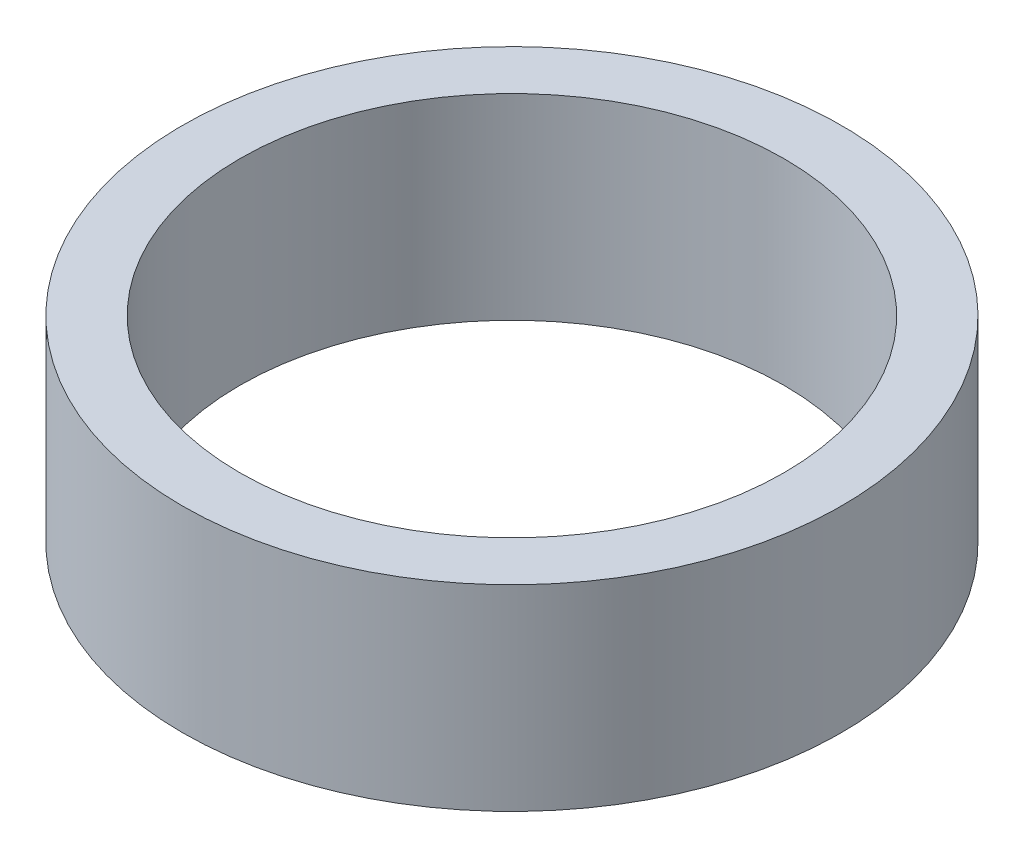
ISO-10303-21;
HEADER;
FILE_DESCRIPTION(('STEP AP214'),'2;1');
FILE_NAME('part.step','',(''),(''),'','','');
FILE_SCHEMA(('AUTOMOTIVE_DESIGN { 1 0 10303 214 1 1 1 1 }'));
ENDSEC;
DATA;
#1=APPLICATION_CONTEXT('core data for automotive mechanical design processes');
#2=APPLICATION_PROTOCOL_DEFINITION('international standard','automotive_design',2000,#1);
#3=PRODUCT_CONTEXT('',#1,'mechanical');
#4=PRODUCT('Part','Part','',(#3));
#5=PRODUCT_RELATED_PRODUCT_CATEGORY('part','',(#4));
#6=PRODUCT_DEFINITION_FORMATION('','',#4);
#7=PRODUCT_DEFINITION_CONTEXT('part definition',#1,'design');
#8=PRODUCT_DEFINITION('design','',#6,#7);
#9=PRODUCT_DEFINITION_SHAPE('','',#8);
#10=(LENGTH_UNIT() NAMED_UNIT(*) SI_UNIT(.MILLI.,.METRE.));
#11=(NAMED_UNIT(*) PLANE_ANGLE_UNIT() SI_UNIT($,.RADIAN.));
#12=(NAMED_UNIT(*) SI_UNIT($,.STERADIAN.) SOLID_ANGLE_UNIT());
#13=UNCERTAINTY_MEASURE_WITH_UNIT(LENGTH_MEASURE(1.E-05),#10,'distance_accuracy_value','');
#14=(GEOMETRIC_REPRESENTATION_CONTEXT(3) GLOBAL_UNCERTAINTY_ASSIGNED_CONTEXT((#13)) GLOBAL_UNIT_ASSIGNED_CONTEXT((#10,
#11,#12)) REPRESENTATION_CONTEXT('',''));
#15=CARTESIAN_POINT('',(0.,0.,0.));
#16=DIRECTION('',(0.,0.,1.));
#17=DIRECTION('',(1.,0.,0.));
#18=AXIS2_PLACEMENT_3D('',#15,#16,#17);
#19=CARTESIAN_POINT('',(0.,14.,0.));
#20=DIRECTION('',(0.,1.,0.));
#21=DIRECTION('',(0.,0.,1.));
#22=AXIS2_PLACEMENT_3D('',#19,#20,#21);
#23=PLANE('',#22);
#24=CARTESIAN_POINT('',(0.,14.,0.));
#25=DIRECTION('',(0.,1.,0.));
#26=DIRECTION('',(0.,0.,1.));
#27=AXIS2_PLACEMENT_3D('',#24,#25,#26);
#28=CIRCLE('',#27,23.5);
#29=CARTESIAN_POINT('',(0.,14.,23.5));
#30=VERTEX_POINT('',#29);
#31=EDGE_CURVE('E10',#30,#30,#28,.T.);
#32=ORIENTED_EDGE('',*,*,#31,.T.);
#33=EDGE_LOOP('',(#32));
#34=FACE_BOUND('',#33,.T.);
#35=CARTESIAN_POINT('',(0.,14.,0.));
#36=DIRECTION('',(0.,1.,0.));
#37=DIRECTION('',(0.,0.,1.));
#38=AXIS2_PLACEMENT_3D('',#35,#36,#37);
#39=CIRCLE('',#38,19.4);
#40=CARTESIAN_POINT('',(0.,14.,19.4));
#41=VERTEX_POINT('',#40);
#42=EDGE_CURVE('E42',#41,#41,#39,.T.);
#43=ORIENTED_EDGE('',*,*,#42,.F.);
#44=EDGE_LOOP('',(#43));
#45=FACE_BOUND('',#44,.T.);
#46=ADVANCED_FACE('F31',(#34,#45),#23,.T.);
#47=CARTESIAN_POINT('',(0.,0.,0.));
#48=DIRECTION('',(0.,1.,0.));
#49=DIRECTION('',(0.,0.,1.));
#50=AXIS2_PLACEMENT_3D('',#47,#48,#49);
#51=PLANE('',#50);
#52=CARTESIAN_POINT('',(0.,0.,0.));
#53=DIRECTION('',(0.,1.,0.));
#54=DIRECTION('',(0.,0.,1.));
#55=AXIS2_PLACEMENT_3D('',#52,#53,#54);
#56=CIRCLE('',#55,23.5);
#57=CARTESIAN_POINT('',(0.,0.,23.5));
#58=VERTEX_POINT('',#57);
#59=EDGE_CURVE('E35',#58,#58,#56,.T.);
#60=ORIENTED_EDGE('',*,*,#59,.F.);
#61=EDGE_LOOP('',(#60));
#62=FACE_BOUND('',#61,.T.);
#63=CARTESIAN_POINT('',(0.,0.,0.));
#64=DIRECTION('',(0.,1.,0.));
#65=DIRECTION('',(0.,0.,1.));
#66=AXIS2_PLACEMENT_3D('',#63,#64,#65);
#67=CIRCLE('',#66,19.4);
#68=CARTESIAN_POINT('',(0.,0.,19.4));
#69=VERTEX_POINT('',#68);
#70=EDGE_CURVE('E44',#69,#69,#67,.T.);
#71=ORIENTED_EDGE('',*,*,#70,.T.);
#72=EDGE_LOOP('',(#71));
#73=FACE_BOUND('',#72,.T.);
#74=ADVANCED_FACE('F54',(#62,#73),#51,.F.);
#75=CARTESIAN_POINT('',(0.,14.,0.));
#76=DIRECTION('',(0.,-1.,0.));
#77=DIRECTION('',(0.,0.,-1.));
#78=AXIS2_PLACEMENT_3D('',#75,#76,#77);
#79=CYLINDRICAL_SURFACE('',#78,23.5);
#80=ORIENTED_EDGE('',*,*,#31,.F.);
#81=EDGE_LOOP('',(#80));
#82=FACE_BOUND('',#81,.T.);
#83=ORIENTED_EDGE('',*,*,#59,.T.);
#84=EDGE_LOOP('',(#83));
#85=FACE_BOUND('',#84,.T.);
#86=ADVANCED_FACE('F33',(#82,#85),#79,.T.);
#87=CARTESIAN_POINT('',(0.,14.,0.));
#88=DIRECTION('',(0.,-1.,0.));
#89=DIRECTION('',(0.,0.,-1.));
#90=AXIS2_PLACEMENT_3D('',#87,#88,#89);
#91=CYLINDRICAL_SURFACE('',#90,19.4);
#92=ORIENTED_EDGE('',*,*,#42,.T.);
#93=EDGE_LOOP('',(#92));
#94=FACE_BOUND('',#93,.T.);
#95=ORIENTED_EDGE('',*,*,#70,.F.);
#96=EDGE_LOOP('',(#95));
#97=FACE_BOUND('',#96,.T.);
#98=ADVANCED_FACE('F50',(#94,#97),#91,.F.);
#99=CLOSED_SHELL('',(#46,#74,#86,#98));
#100=MANIFOLD_SOLID_BREP('B2',#99);
#101=ADVANCED_BREP_SHAPE_REPRESENTATION('',(#18,#100),#14);
#102=SHAPE_DEFINITION_REPRESENTATION(#9,#101);
ENDSEC;
END-ISO-10303-21;
